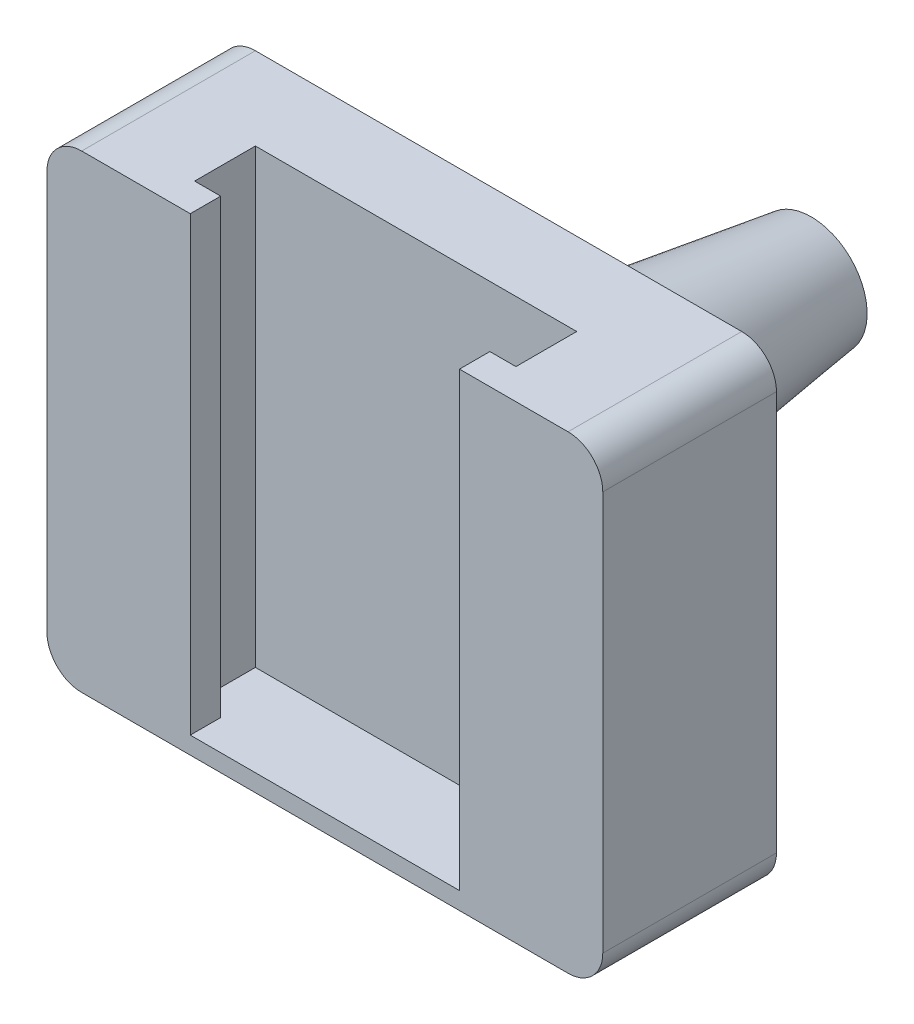
ISO-10303-21;
HEADER;
FILE_DESCRIPTION(('STEP AP214'),'2;1');
FILE_NAME('part.step','',(''),(''),'','','');
FILE_SCHEMA(('AUTOMOTIVE_DESIGN { 1 0 10303 214 1 1 1 1 }'));
ENDSEC;
DATA;
#1=APPLICATION_CONTEXT('core data for automotive mechanical design processes');
#2=APPLICATION_PROTOCOL_DEFINITION('international standard','automotive_design',2000,#1);
#3=PRODUCT_CONTEXT('',#1,'mechanical');
#4=PRODUCT('Part','Part','',(#3));
#5=PRODUCT_RELATED_PRODUCT_CATEGORY('part','',(#4));
#6=PRODUCT_DEFINITION_FORMATION('','',#4);
#7=PRODUCT_DEFINITION_CONTEXT('part definition',#1,'design');
#8=PRODUCT_DEFINITION('design','',#6,#7);
#9=PRODUCT_DEFINITION_SHAPE('','',#8);
#10=(LENGTH_UNIT() NAMED_UNIT(*) SI_UNIT(.MILLI.,.METRE.));
#11=(NAMED_UNIT(*) PLANE_ANGLE_UNIT() SI_UNIT($,.RADIAN.));
#12=(NAMED_UNIT(*) SI_UNIT($,.STERADIAN.) SOLID_ANGLE_UNIT());
#13=UNCERTAINTY_MEASURE_WITH_UNIT(LENGTH_MEASURE(1.E-05),#10,'distance_accuracy_value','');
#14=(GEOMETRIC_REPRESENTATION_CONTEXT(3) GLOBAL_UNCERTAINTY_ASSIGNED_CONTEXT((#13)) GLOBAL_UNIT_ASSIGNED_CONTEXT((#10,
#11,#12)) REPRESENTATION_CONTEXT('',''));
#15=CARTESIAN_POINT('',(0.,0.,0.));
#16=DIRECTION('',(0.,0.,1.));
#17=DIRECTION('',(1.,0.,0.));
#18=AXIS2_PLACEMENT_3D('',#15,#16,#17);
#19=CARTESIAN_POINT('',(0.,0.,10.));
#20=DIRECTION('',(0.,0.,-1.));
#21=DIRECTION('',(-1.,0.,0.));
#22=AXIS2_PLACEMENT_3D('',#19,#20,#21);
#23=PLANE('',#22);
#24=DIRECTION('',(0.,1.,0.));
#25=VECTOR('',#24,1.);
#26=CARTESIAN_POINT('',(7.75,-32.7305096136323,10.));
#27=LINE('',#26,#25);
#28=CARTESIAN_POINT('',(7.75,-12.5000000000001,10.));
#29=VERTEX_POINT('',#28);
#30=CARTESIAN_POINT('',(7.75,13.5,10.));
#31=VERTEX_POINT('',#30);
#32=EDGE_CURVE('E158',#29,#31,#27,.T.);
#33=ORIENTED_EDGE('',*,*,#32,.F.);
#34=DIRECTION('',(-1.,0.,0.));
#35=VECTOR('',#34,1.);
#36=CARTESIAN_POINT('',(-7.75,-12.5000000000001,10.));
#37=LINE('',#36,#35);
#38=CARTESIAN_POINT('',(-7.75,-12.5000000000001,10.));
#39=VERTEX_POINT('',#38);
#40=EDGE_CURVE('E339',#29,#39,#37,.T.);
#41=ORIENTED_EDGE('',*,*,#40,.T.);
#42=DIRECTION('',(0.,1.,0.));
#43=VECTOR('',#42,1.);
#44=CARTESIAN_POINT('',(-7.75,-32.7305096136323,10.));
#45=LINE('',#44,#43);
#46=CARTESIAN_POINT('',(-7.75,13.5,10.));
#47=VERTEX_POINT('',#46);
#48=EDGE_CURVE('E57',#39,#47,#45,.T.);
#49=ORIENTED_EDGE('',*,*,#48,.T.);
#50=DIRECTION('',(1.,0.,0.));
#51=VECTOR('',#50,1.);
#52=CARTESIAN_POINT('',(-15.9999999999999,13.5,10.));
#53=LINE('',#52,#51);
#54=CARTESIAN_POINT('',(-13.9999999999999,13.5,10.));
#55=VERTEX_POINT('',#54);
#56=EDGE_CURVE('E177',#55,#47,#53,.T.);
#57=ORIENTED_EDGE('',*,*,#56,.F.);
#58=CARTESIAN_POINT('',(-13.9999999999999,11.5,10.));
#59=DIRECTION('',(0.,0.,-1.));
#60=DIRECTION('',(-1.,0.,0.));
#61=AXIS2_PLACEMENT_3D('',#58,#59,#60);
#62=CIRCLE('',#61,2.);
#63=CARTESIAN_POINT('',(-15.9999999999999,11.5,10.));
#64=VERTEX_POINT('',#63);
#65=EDGE_CURVE('E225',#55,#64,#62,.F.);
#66=ORIENTED_EDGE('',*,*,#65,.T.);
#67=DIRECTION('',(0.,1.,0.));
#68=VECTOR('',#67,1.);
#69=CARTESIAN_POINT('',(-15.9999999999999,-13.5000000000001,10.));
#70=LINE('',#69,#68);
#71=CARTESIAN_POINT('',(-15.9999999999999,-11.5000000000001,10.));
#72=VERTEX_POINT('',#71);
#73=EDGE_CURVE('E179',#72,#64,#70,.T.);
#74=ORIENTED_EDGE('',*,*,#73,.F.);
#75=CARTESIAN_POINT('',(-13.9999999999999,-11.5000000000001,10.));
#76=DIRECTION('',(0.,0.,-1.));
#77=DIRECTION('',(-1.,0.,0.));
#78=AXIS2_PLACEMENT_3D('',#75,#76,#77);
#79=CIRCLE('',#78,2.);
#80=CARTESIAN_POINT('',(-13.9999999999999,-13.5000000000001,10.));
#81=VERTEX_POINT('',#80);
#82=EDGE_CURVE('E222',#72,#81,#79,.F.);
#83=ORIENTED_EDGE('',*,*,#82,.T.);
#84=DIRECTION('',(1.,0.,0.));
#85=VECTOR('',#84,1.);
#86=CARTESIAN_POINT('',(-15.9999999999999,-13.5000000000001,10.));
#87=LINE('',#86,#85);
#88=CARTESIAN_POINT('',(14.0000000000001,-13.5000000000001,10.));
#89=VERTEX_POINT('',#88);
#90=EDGE_CURVE('E188',#81,#89,#87,.T.);
#91=ORIENTED_EDGE('',*,*,#90,.T.);
#92=CARTESIAN_POINT('',(14.0000000000001,-11.5000000000001,10.));
#93=DIRECTION('',(0.,0.,-1.));
#94=DIRECTION('',(-1.,0.,0.));
#95=AXIS2_PLACEMENT_3D('',#92,#93,#94);
#96=CIRCLE('',#95,2.);
#97=CARTESIAN_POINT('',(16.0000000000001,-11.5000000000001,10.));
#98=VERTEX_POINT('',#97);
#99=EDGE_CURVE('E227',#89,#98,#96,.F.);
#100=ORIENTED_EDGE('',*,*,#99,.T.);
#101=DIRECTION('',(0.,1.,0.));
#102=VECTOR('',#101,1.);
#103=CARTESIAN_POINT('',(16.0000000000001,-13.5000000000001,10.));
#104=LINE('',#103,#102);
#105=CARTESIAN_POINT('',(16.0000000000001,11.5,10.));
#106=VERTEX_POINT('',#105);
#107=EDGE_CURVE('E182',#98,#106,#104,.T.);
#108=ORIENTED_EDGE('',*,*,#107,.T.);
#109=CARTESIAN_POINT('',(14.0000000000001,11.5,10.));
#110=DIRECTION('',(0.,0.,-1.));
#111=DIRECTION('',(-1.,0.,0.));
#112=AXIS2_PLACEMENT_3D('',#109,#110,#111);
#113=CIRCLE('',#112,2.);
#114=CARTESIAN_POINT('',(14.0000000000001,13.5,10.));
#115=VERTEX_POINT('',#114);
#116=EDGE_CURVE('E180',#106,#115,#113,.F.);
#117=ORIENTED_EDGE('',*,*,#116,.T.);
#118=EDGE_CURVE('E61',#31,#115,#53,.T.);
#119=ORIENTED_EDGE('',*,*,#118,.F.);
#120=EDGE_LOOP('',(#33,#41,#49,#57,#66,#74,#83,#91,#100,#108,#117,#119));
#121=FACE_BOUND('',#120,.T.);
#122=ADVANCED_FACE('F41',(#121),#23,.F.);
#123=CARTESIAN_POINT('',(-15.9999999999999,-13.5000000000001,10.));
#124=DIRECTION('',(-1.,0.,0.));
#125=DIRECTION('',(0.,0.,1.));
#126=AXIS2_PLACEMENT_3D('',#123,#124,#125);
#127=PLANE('',#126);
#128=DIRECTION('',(0.,1.,0.));
#129=VECTOR('',#128,1.);
#130=CARTESIAN_POINT('',(-15.9999999999999,-13.5000000000001,0.));
#131=LINE('',#130,#129);
#132=CARTESIAN_POINT('',(-15.9999999999999,-11.5000000000001,0.));
#133=VERTEX_POINT('',#132);
#134=CARTESIAN_POINT('',(-15.9999999999999,11.5,0.));
#135=VERTEX_POINT('',#134);
#136=EDGE_CURVE('E191',#133,#135,#131,.T.);
#137=ORIENTED_EDGE('',*,*,#136,.F.);
#138=DIRECTION('',(0.,0.,-1.));
#139=VECTOR('',#138,1.);
#140=CARTESIAN_POINT('',(-15.9999999999999,-11.5000000000001,10.));
#141=LINE('',#140,#139);
#142=EDGE_CURVE('E235',#133,#72,#141,.F.);
#143=ORIENTED_EDGE('',*,*,#142,.T.);
#144=ORIENTED_EDGE('',*,*,#73,.T.);
#145=DIRECTION('',(0.,0.,-1.));
#146=VECTOR('',#145,1.);
#147=CARTESIAN_POINT('',(-15.9999999999999,11.5,10.));
#148=LINE('',#147,#146);
#149=EDGE_CURVE('E230',#64,#135,#148,.T.);
#150=ORIENTED_EDGE('',*,*,#149,.T.);
#151=EDGE_LOOP('',(#137,#143,#144,#150));
#152=FACE_BOUND('',#151,.T.);
#153=ADVANCED_FACE('F251',(#152),#127,.T.);
#154=CARTESIAN_POINT('',(-15.9999999999999,-13.5000000000001,10.));
#155=DIRECTION('',(0.,1.,0.));
#156=DIRECTION('',(0.,0.,1.));
#157=AXIS2_PLACEMENT_3D('',#154,#155,#156);
#158=PLANE('',#157);
#159=DIRECTION('',(1.,0.,0.));
#160=VECTOR('',#159,1.);
#161=CARTESIAN_POINT('',(-15.9999999999999,-13.5000000000001,0.));
#162=LINE('',#161,#160);
#163=CARTESIAN_POINT('',(-13.9999999999999,-13.5000000000001,0.));
#164=VERTEX_POINT('',#163);
#165=CARTESIAN_POINT('',(14.0000000000001,-13.5000000000001,0.));
#166=VERTEX_POINT('',#165);
#167=EDGE_CURVE('E184',#164,#166,#162,.T.);
#168=ORIENTED_EDGE('',*,*,#167,.T.);
#169=DIRECTION('',(0.,0.,-1.));
#170=VECTOR('',#169,1.);
#171=CARTESIAN_POINT('',(14.0000000000001,-13.5000000000001,10.));
#172=LINE('',#171,#170);
#173=EDGE_CURVE('E216',#166,#89,#172,.F.);
#174=ORIENTED_EDGE('',*,*,#173,.T.);
#175=ORIENTED_EDGE('',*,*,#90,.F.);
#176=DIRECTION('',(0.,0.,-1.));
#177=VECTOR('',#176,1.);
#178=CARTESIAN_POINT('',(-13.9999999999999,-13.5000000000001,0.));
#179=LINE('',#178,#177);
#180=EDGE_CURVE('E219',#81,#164,#179,.T.);
#181=ORIENTED_EDGE('',*,*,#180,.T.);
#182=EDGE_LOOP('',(#168,#174,#175,#181));
#183=FACE_BOUND('',#182,.T.);
#184=ADVANCED_FACE('F263',(#183),#158,.F.);
#185=CARTESIAN_POINT('',(16.0000000000001,-13.5000000000001,10.));
#186=DIRECTION('',(-1.,0.,0.));
#187=DIRECTION('',(0.,0.,1.));
#188=AXIS2_PLACEMENT_3D('',#185,#186,#187);
#189=PLANE('',#188);
#190=ORIENTED_EDGE('',*,*,#107,.F.);
#191=DIRECTION('',(0.,0.,-1.));
#192=VECTOR('',#191,1.);
#193=CARTESIAN_POINT('',(16.0000000000001,-11.5000000000001,10.));
#194=LINE('',#193,#192);
#195=CARTESIAN_POINT('',(16.0000000000001,-11.5000000000001,0.));
#196=VERTEX_POINT('',#195);
#197=EDGE_CURVE('E207',#98,#196,#194,.T.);
#198=ORIENTED_EDGE('',*,*,#197,.T.);
#199=DIRECTION('',(0.,1.,0.));
#200=VECTOR('',#199,1.);
#201=CARTESIAN_POINT('',(16.0000000000001,-13.5000000000001,0.));
#202=LINE('',#201,#200);
#203=CARTESIAN_POINT('',(16.0000000000001,11.5,0.));
#204=VERTEX_POINT('',#203);
#205=EDGE_CURVE('E196',#196,#204,#202,.T.);
#206=ORIENTED_EDGE('',*,*,#205,.T.);
#207=DIRECTION('',(0.,0.,-1.));
#208=VECTOR('',#207,1.);
#209=CARTESIAN_POINT('',(16.0000000000001,11.5,10.));
#210=LINE('',#209,#208);
#211=EDGE_CURVE('E194',#204,#106,#210,.F.);
#212=ORIENTED_EDGE('',*,*,#211,.T.);
#213=EDGE_LOOP('',(#190,#198,#206,#212));
#214=FACE_BOUND('',#213,.T.);
#215=ADVANCED_FACE('F274',(#214),#189,.F.);
#216=CARTESIAN_POINT('',(-15.9999999999999,13.5,10.));
#217=DIRECTION('',(0.,1.,0.));
#218=DIRECTION('',(0.,0.,1.));
#219=AXIS2_PLACEMENT_3D('',#216,#217,#218);
#220=PLANE('',#219);
#221=DIRECTION('',(0.,0.,-1.));
#222=VECTOR('',#221,1.);
#223=CARTESIAN_POINT('',(7.75,13.5,8.25));
#224=LINE('',#223,#222);
#225=CARTESIAN_POINT('',(7.75,13.5,8.25));
#226=VERTEX_POINT('',#225);
#227=EDGE_CURVE('E159',#31,#226,#224,.T.);
#228=ORIENTED_EDGE('',*,*,#227,.F.);
#229=ORIENTED_EDGE('',*,*,#118,.T.);
#230=DIRECTION('',(0.,0.,-1.));
#231=VECTOR('',#230,1.);
#232=CARTESIAN_POINT('',(14.0000000000001,13.5,0.));
#233=LINE('',#232,#231);
#234=CARTESIAN_POINT('',(14.0000000000001,13.5,0.));
#235=VERTEX_POINT('',#234);
#236=EDGE_CURVE('E236',#115,#235,#233,.T.);
#237=ORIENTED_EDGE('',*,*,#236,.T.);
#238=DIRECTION('',(1.,0.,0.));
#239=VECTOR('',#238,1.);
#240=CARTESIAN_POINT('',(-15.9999999999999,13.5,0.));
#241=LINE('',#240,#239);
#242=CARTESIAN_POINT('',(-13.9999999999999,13.5,0.));
#243=VERTEX_POINT('',#242);
#244=EDGE_CURVE('E199',#243,#235,#241,.T.);
#245=ORIENTED_EDGE('',*,*,#244,.F.);
#246=DIRECTION('',(0.,0.,-1.));
#247=VECTOR('',#246,1.);
#248=CARTESIAN_POINT('',(-13.9999999999999,13.5,10.));
#249=LINE('',#248,#247);
#250=EDGE_CURVE('E234',#243,#55,#249,.F.);
#251=ORIENTED_EDGE('',*,*,#250,.T.);
#252=ORIENTED_EDGE('',*,*,#56,.T.);
#253=DIRECTION('',(0.,0.,1.));
#254=VECTOR('',#253,1.);
#255=CARTESIAN_POINT('',(-7.75,13.5,10.));
#256=LINE('',#255,#254);
#257=CARTESIAN_POINT('',(-7.75,13.5,8.25));
#258=VERTEX_POINT('',#257);
#259=EDGE_CURVE('E170',#258,#47,#256,.T.);
#260=ORIENTED_EDGE('',*,*,#259,.F.);
#261=DIRECTION('',(1.,0.,0.));
#262=VECTOR('',#261,1.);
#263=CARTESIAN_POINT('',(-7.75,13.5,8.25));
#264=LINE('',#263,#262);
#265=CARTESIAN_POINT('',(-9.24999999999993,13.5,8.25));
#266=VERTEX_POINT('',#265);
#267=EDGE_CURVE('E322',#266,#258,#264,.T.);
#268=ORIENTED_EDGE('',*,*,#267,.F.);
#269=DIRECTION('',(0.,0.,1.));
#270=VECTOR('',#269,1.);
#271=CARTESIAN_POINT('',(-9.24999999999993,13.5,8.25));
#272=LINE('',#271,#270);
#273=CARTESIAN_POINT('',(-9.25,13.5,4.75));
#274=VERTEX_POINT('',#273);
#275=EDGE_CURVE('E324',#274,#266,#272,.T.);
#276=ORIENTED_EDGE('',*,*,#275,.F.);
#277=DIRECTION('',(-1.,0.,0.));
#278=VECTOR('',#277,1.);
#279=CARTESIAN_POINT('',(-9.25,13.5,4.75));
#280=LINE('',#279,#278);
#281=CARTESIAN_POINT('',(9.25,13.5,4.75));
#282=VERTEX_POINT('',#281);
#283=EDGE_CURVE('E346',#282,#274,#280,.T.);
#284=ORIENTED_EDGE('',*,*,#283,.F.);
#285=DIRECTION('',(0.,0.,-1.));
#286=VECTOR('',#285,1.);
#287=CARTESIAN_POINT('',(9.25,13.5,4.75));
#288=LINE('',#287,#286);
#289=CARTESIAN_POINT('',(9.24999999999993,13.5,8.25));
#290=VERTEX_POINT('',#289);
#291=EDGE_CURVE('E349',#290,#282,#288,.T.);
#292=ORIENTED_EDGE('',*,*,#291,.F.);
#293=DIRECTION('',(1.,0.,0.));
#294=VECTOR('',#293,1.);
#295=CARTESIAN_POINT('',(9.24999999999993,13.5,8.25));
#296=LINE('',#295,#294);
#297=EDGE_CURVE('E175',#226,#290,#296,.T.);
#298=ORIENTED_EDGE('',*,*,#297,.F.);
#299=EDGE_LOOP('',(#228,#229,#237,#245,#251,#252,#260,#268,#276,#284,#292,#298));
#300=FACE_BOUND('',#299,.T.);
#301=ADVANCED_FACE('F169',(#300),#220,.T.);
#302=CARTESIAN_POINT('',(0.,0.,0.));
#303=DIRECTION('',(0.,0.,-1.));
#304=DIRECTION('',(-1.,0.,0.));
#305=AXIS2_PLACEMENT_3D('',#302,#303,#304);
#306=PLANE('',#305);
#307=CARTESIAN_POINT('',(0.,0.,0.));
#308=DIRECTION('',(0.,0.,-1.));
#309=DIRECTION('',(-1.,0.,0.));
#310=AXIS2_PLACEMENT_3D('',#307,#308,#309);
#311=CIRCLE('',#310,7.48857347563245);
#312=CARTESIAN_POINT('',(-7.48857347563245,0.,0.));
#313=VERTEX_POINT('',#312);
#314=EDGE_CURVE('E12',#313,#313,#311,.F.);
#315=ORIENTED_EDGE('',*,*,#314,.T.);
#316=EDGE_LOOP('',(#315));
#317=FACE_BOUND('',#316,.T.);
#318=ORIENTED_EDGE('',*,*,#205,.F.);
#319=CARTESIAN_POINT('',(14.0000000000001,-11.5000000000001,0.));
#320=DIRECTION('',(0.,0.,-1.));
#321=DIRECTION('',(-1.,0.,0.));
#322=AXIS2_PLACEMENT_3D('',#319,#320,#321);
#323=CIRCLE('',#322,2.);
#324=EDGE_CURVE('E213',#196,#166,#323,.T.);
#325=ORIENTED_EDGE('',*,*,#324,.T.);
#326=ORIENTED_EDGE('',*,*,#167,.F.);
#327=CARTESIAN_POINT('',(-13.9999999999999,-11.5000000000001,0.));
#328=DIRECTION('',(0.,0.,-1.));
#329=DIRECTION('',(-1.,0.,0.));
#330=AXIS2_PLACEMENT_3D('',#327,#328,#329);
#331=CIRCLE('',#330,2.);
#332=EDGE_CURVE('E214',#164,#133,#331,.T.);
#333=ORIENTED_EDGE('',*,*,#332,.T.);
#334=ORIENTED_EDGE('',*,*,#136,.T.);
#335=CARTESIAN_POINT('',(-13.9999999999999,11.5,0.));
#336=DIRECTION('',(0.,0.,-1.));
#337=DIRECTION('',(-1.,0.,0.));
#338=AXIS2_PLACEMENT_3D('',#335,#336,#337);
#339=CIRCLE('',#338,2.);
#340=EDGE_CURVE('E209',#135,#243,#339,.T.);
#341=ORIENTED_EDGE('',*,*,#340,.T.);
#342=ORIENTED_EDGE('',*,*,#244,.T.);
#343=CARTESIAN_POINT('',(14.0000000000001,11.5,0.));
#344=DIRECTION('',(0.,0.,-1.));
#345=DIRECTION('',(-1.,0.,0.));
#346=AXIS2_PLACEMENT_3D('',#343,#344,#345);
#347=CIRCLE('',#346,2.);
#348=EDGE_CURVE('E212',#235,#204,#347,.T.);
#349=ORIENTED_EDGE('',*,*,#348,.T.);
#350=EDGE_LOOP('',(#318,#325,#326,#333,#334,#341,#342,#349));
#351=FACE_BOUND('',#350,.T.);
#352=ADVANCED_FACE('F270',(#317,#351),#306,.T.);
#353=CARTESIAN_POINT('',(14.0000000000001,-11.5000000000001,10.));
#354=DIRECTION('',(0.,0.,-1.));
#355=DIRECTION('',(-1.,0.,0.));
#356=AXIS2_PLACEMENT_3D('',#353,#354,#355);
#357=CYLINDRICAL_SURFACE('',#356,2.);
#358=ORIENTED_EDGE('',*,*,#99,.F.);
#359=ORIENTED_EDGE('',*,*,#173,.F.);
#360=ORIENTED_EDGE('',*,*,#324,.F.);
#361=ORIENTED_EDGE('',*,*,#197,.F.);
#362=EDGE_LOOP('',(#358,#359,#360,#361));
#363=FACE_BOUND('',#362,.T.);
#364=ADVANCED_FACE('F267',(#363),#357,.T.);
#365=CARTESIAN_POINT('',(-13.9999999999999,-11.5000000000001,10.));
#366=DIRECTION('',(0.,0.,1.));
#367=DIRECTION('',(1.,0.,0.));
#368=AXIS2_PLACEMENT_3D('',#365,#366,#367);
#369=CYLINDRICAL_SURFACE('',#368,2.);
#370=ORIENTED_EDGE('',*,*,#82,.F.);
#371=ORIENTED_EDGE('',*,*,#142,.F.);
#372=ORIENTED_EDGE('',*,*,#332,.F.);
#373=ORIENTED_EDGE('',*,*,#180,.F.);
#374=EDGE_LOOP('',(#370,#371,#372,#373));
#375=FACE_BOUND('',#374,.T.);
#376=ADVANCED_FACE('F284',(#375),#369,.T.);
#377=CARTESIAN_POINT('',(14.0000000000001,11.5,10.));
#378=DIRECTION('',(0.,0.,1.));
#379=DIRECTION('',(1.,0.,0.));
#380=AXIS2_PLACEMENT_3D('',#377,#378,#379);
#381=CYLINDRICAL_SURFACE('',#380,2.);
#382=ORIENTED_EDGE('',*,*,#116,.F.);
#383=ORIENTED_EDGE('',*,*,#211,.F.);
#384=ORIENTED_EDGE('',*,*,#348,.F.);
#385=ORIENTED_EDGE('',*,*,#236,.F.);
#386=EDGE_LOOP('',(#382,#383,#384,#385));
#387=FACE_BOUND('',#386,.T.);
#388=ADVANCED_FACE('F288',(#387),#381,.T.);
#389=CARTESIAN_POINT('',(-13.9999999999999,11.5,10.));
#390=DIRECTION('',(0.,0.,-1.));
#391=DIRECTION('',(-1.,0.,0.));
#392=AXIS2_PLACEMENT_3D('',#389,#390,#391);
#393=CYLINDRICAL_SURFACE('',#392,2.);
#394=ORIENTED_EDGE('',*,*,#65,.F.);
#395=ORIENTED_EDGE('',*,*,#250,.F.);
#396=ORIENTED_EDGE('',*,*,#340,.F.);
#397=ORIENTED_EDGE('',*,*,#149,.F.);
#398=EDGE_LOOP('',(#394,#395,#396,#397));
#399=FACE_BOUND('',#398,.T.);
#400=ADVANCED_FACE('F289',(#399),#393,.T.);
#401=CARTESIAN_POINT('',(-7.75,-32.7305096136323,10.));
#402=DIRECTION('',(-1.,0.,0.));
#403=DIRECTION('',(0.,0.,1.));
#404=AXIS2_PLACEMENT_3D('',#401,#402,#403);
#405=PLANE('',#404);
#406=DIRECTION('',(0.,0.,-1.));
#407=VECTOR('',#406,1.);
#408=CARTESIAN_POINT('',(-7.75,-12.5000000000001,10.));
#409=LINE('',#408,#407);
#410=CARTESIAN_POINT('',(-7.75,-12.5000000000001,8.25));
#411=VERTEX_POINT('',#410);
#412=EDGE_CURVE('E338',#39,#411,#409,.T.);
#413=ORIENTED_EDGE('',*,*,#412,.T.);
#414=DIRECTION('',(0.,1.,0.));
#415=VECTOR('',#414,1.);
#416=CARTESIAN_POINT('',(-7.75,-32.7305096136323,8.25));
#417=LINE('',#416,#415);
#418=EDGE_CURVE('E330',#411,#258,#417,.T.);
#419=ORIENTED_EDGE('',*,*,#418,.T.);
#420=ORIENTED_EDGE('',*,*,#259,.T.);
#421=ORIENTED_EDGE('',*,*,#48,.F.);
#422=EDGE_LOOP('',(#413,#419,#420,#421));
#423=FACE_BOUND('',#422,.T.);
#424=ADVANCED_FACE('F293',(#423),#405,.F.);
#425=CARTESIAN_POINT('',(-7.75,-32.7305096136323,8.25));
#426=DIRECTION('',(0.,0.,1.));
#427=DIRECTION('',(1.,0.,0.));
#428=AXIS2_PLACEMENT_3D('',#425,#426,#427);
#429=PLANE('',#428);
#430=DIRECTION('',(-1.,0.,0.));
#431=VECTOR('',#430,1.);
#432=CARTESIAN_POINT('',(-7.75,-12.5000000000001,8.25));
#433=LINE('',#432,#431);
#434=CARTESIAN_POINT('',(-9.24999999999993,-12.5000000000001,8.25));
#435=VERTEX_POINT('',#434);
#436=EDGE_CURVE('E345',#411,#435,#433,.T.);
#437=ORIENTED_EDGE('',*,*,#436,.T.);
#438=DIRECTION('',(0.,1.,0.));
#439=VECTOR('',#438,1.);
#440=CARTESIAN_POINT('',(-9.24999999999993,-32.7305096136323,8.25));
#441=LINE('',#440,#439);
#442=EDGE_CURVE('E333',#435,#266,#441,.T.);
#443=ORIENTED_EDGE('',*,*,#442,.T.);
#444=ORIENTED_EDGE('',*,*,#267,.T.);
#445=ORIENTED_EDGE('',*,*,#418,.F.);
#446=EDGE_LOOP('',(#437,#443,#444,#445));
#447=FACE_BOUND('',#446,.T.);
#448=ADVANCED_FACE('F298',(#447),#429,.F.);
#449=CARTESIAN_POINT('',(-9.24999999999993,-32.7305096136323,8.25));
#450=DIRECTION('',(-1.,0.,0.));
#451=DIRECTION('',(0.,0.,1.));
#452=AXIS2_PLACEMENT_3D('',#449,#450,#451);
#453=PLANE('',#452);
#454=DIRECTION('',(0.,0.,-1.));
#455=VECTOR('',#454,1.);
#456=CARTESIAN_POINT('',(-9.24999999999993,-12.5000000000001,8.25));
#457=LINE('',#456,#455);
#458=CARTESIAN_POINT('',(-9.25,-12.5000000000001,4.75));
#459=VERTEX_POINT('',#458);
#460=EDGE_CURVE('E380',#435,#459,#457,.T.);
#461=ORIENTED_EDGE('',*,*,#460,.T.);
#462=DIRECTION('',(0.,1.,0.));
#463=VECTOR('',#462,1.);
#464=CARTESIAN_POINT('',(-9.25,-32.7305096136323,4.75));
#465=LINE('',#464,#463);
#466=EDGE_CURVE('E331',#459,#274,#465,.T.);
#467=ORIENTED_EDGE('',*,*,#466,.T.);
#468=ORIENTED_EDGE('',*,*,#275,.T.);
#469=ORIENTED_EDGE('',*,*,#442,.F.);
#470=EDGE_LOOP('',(#461,#467,#468,#469));
#471=FACE_BOUND('',#470,.T.);
#472=ADVANCED_FACE('F352',(#471),#453,.F.);
#473=CARTESIAN_POINT('',(-9.25,-32.7305096136323,4.75));
#474=DIRECTION('',(0.,0.,-1.));
#475=DIRECTION('',(-1.,0.,0.));
#476=AXIS2_PLACEMENT_3D('',#473,#474,#475);
#477=PLANE('',#476);
#478=DIRECTION('',(1.,0.,0.));
#479=VECTOR('',#478,1.);
#480=CARTESIAN_POINT('',(-9.25,-12.5000000000001,4.75));
#481=LINE('',#480,#479);
#482=CARTESIAN_POINT('',(9.25,-12.5000000000001,4.75));
#483=VERTEX_POINT('',#482);
#484=EDGE_CURVE('E365',#459,#483,#481,.T.);
#485=ORIENTED_EDGE('',*,*,#484,.T.);
#486=DIRECTION('',(0.,1.,0.));
#487=VECTOR('',#486,1.);
#488=CARTESIAN_POINT('',(9.25,-32.7305096136323,4.75));
#489=LINE('',#488,#487);
#490=EDGE_CURVE('E332',#483,#282,#489,.T.);
#491=ORIENTED_EDGE('',*,*,#490,.T.);
#492=ORIENTED_EDGE('',*,*,#283,.T.);
#493=ORIENTED_EDGE('',*,*,#466,.F.);
#494=EDGE_LOOP('',(#485,#491,#492,#493));
#495=FACE_BOUND('',#494,.T.);
#496=ADVANCED_FACE('F360',(#495),#477,.F.);
#497=CARTESIAN_POINT('',(9.25,-32.7305096136323,4.75));
#498=DIRECTION('',(1.,0.,0.));
#499=DIRECTION('',(0.,0.,-1.));
#500=AXIS2_PLACEMENT_3D('',#497,#498,#499);
#501=PLANE('',#500);
#502=DIRECTION('',(0.,0.,1.));
#503=VECTOR('',#502,1.);
#504=CARTESIAN_POINT('',(9.25,-12.5000000000001,4.75));
#505=LINE('',#504,#503);
#506=CARTESIAN_POINT('',(9.24999999999993,-12.5000000000001,8.25));
#507=VERTEX_POINT('',#506);
#508=EDGE_CURVE('E370',#483,#507,#505,.T.);
#509=ORIENTED_EDGE('',*,*,#508,.T.);
#510=DIRECTION('',(0.,1.,0.));
#511=VECTOR('',#510,1.);
#512=CARTESIAN_POINT('',(9.24999999999993,-32.7305096136323,8.25));
#513=LINE('',#512,#511);
#514=EDGE_CURVE('E340',#507,#290,#513,.T.);
#515=ORIENTED_EDGE('',*,*,#514,.T.);
#516=ORIENTED_EDGE('',*,*,#291,.T.);
#517=ORIENTED_EDGE('',*,*,#490,.F.);
#518=EDGE_LOOP('',(#509,#515,#516,#517));
#519=FACE_BOUND('',#518,.T.);
#520=ADVANCED_FACE('F362',(#519),#501,.F.);
#521=CARTESIAN_POINT('',(9.24999999999993,-32.7305096136323,8.25));
#522=DIRECTION('',(0.,0.,1.));
#523=DIRECTION('',(1.,0.,0.));
#524=AXIS2_PLACEMENT_3D('',#521,#522,#523);
#525=PLANE('',#524);
#526=DIRECTION('',(-1.,0.,0.));
#527=VECTOR('',#526,1.);
#528=CARTESIAN_POINT('',(9.24999999999993,-12.5000000000001,8.25));
#529=LINE('',#528,#527);
#530=CARTESIAN_POINT('',(7.75,-12.5000000000001,8.25));
#531=VERTEX_POINT('',#530);
#532=EDGE_CURVE('E327',#507,#531,#529,.T.);
#533=ORIENTED_EDGE('',*,*,#532,.T.);
#534=DIRECTION('',(0.,1.,0.));
#535=VECTOR('',#534,1.);
#536=CARTESIAN_POINT('',(7.75,-32.7305096136323,8.25));
#537=LINE('',#536,#535);
#538=EDGE_CURVE('E168',#531,#226,#537,.T.);
#539=ORIENTED_EDGE('',*,*,#538,.T.);
#540=ORIENTED_EDGE('',*,*,#297,.T.);
#541=ORIENTED_EDGE('',*,*,#514,.F.);
#542=EDGE_LOOP('',(#533,#539,#540,#541));
#543=FACE_BOUND('',#542,.T.);
#544=ADVANCED_FACE('F369',(#543),#525,.F.);
#545=CARTESIAN_POINT('',(7.75,-32.7305096136323,8.25));
#546=DIRECTION('',(1.,0.,0.));
#547=DIRECTION('',(0.,0.,-1.));
#548=AXIS2_PLACEMENT_3D('',#545,#546,#547);
#549=PLANE('',#548);
#550=DIRECTION('',(0.,0.,1.));
#551=VECTOR('',#550,1.);
#552=CARTESIAN_POINT('',(7.75,-12.5000000000001,8.25));
#553=LINE('',#552,#551);
#554=EDGE_CURVE('E162',#531,#29,#553,.T.);
#555=ORIENTED_EDGE('',*,*,#554,.T.);
#556=ORIENTED_EDGE('',*,*,#32,.T.);
#557=ORIENTED_EDGE('',*,*,#227,.T.);
#558=ORIENTED_EDGE('',*,*,#538,.F.);
#559=EDGE_LOOP('',(#555,#556,#557,#558));
#560=FACE_BOUND('',#559,.T.);
#561=ADVANCED_FACE('F160',(#560),#549,.F.);
#562=CARTESIAN_POINT('',(-15.9999999999999,-12.5000000000001,10.));
#563=DIRECTION('',(0.,1.,0.));
#564=DIRECTION('',(0.,0.,1.));
#565=AXIS2_PLACEMENT_3D('',#562,#563,#564);
#566=PLANE('',#565);
#567=ORIENTED_EDGE('',*,*,#40,.F.);
#568=ORIENTED_EDGE('',*,*,#554,.F.);
#569=ORIENTED_EDGE('',*,*,#532,.F.);
#570=ORIENTED_EDGE('',*,*,#508,.F.);
#571=ORIENTED_EDGE('',*,*,#484,.F.);
#572=ORIENTED_EDGE('',*,*,#460,.F.);
#573=ORIENTED_EDGE('',*,*,#436,.F.);
#574=ORIENTED_EDGE('',*,*,#412,.F.);
#575=EDGE_LOOP('',(#567,#568,#569,#570,#571,#572,#573,#574));
#576=FACE_BOUND('',#575,.T.);
#577=ADVANCED_FACE('F375',(#576),#566,.T.);
#578=CARTESIAN_POINT('',(0.,0.,0.));
#579=DIRECTION('',(0.,0.,1.));
#580=DIRECTION('',(-1.,0.,0.));
#581=AXIS2_PLACEMENT_3D('',#578,#579,#580);
#582=CONICAL_SURFACE('',#581,5.75,0.139626340159547);
#583=CARTESIAN_POINT('',(0.,0.,-1.72165379807988));
#584=DIRECTION('',(0.,0.,-1.));
#585=DIRECTION('',(-1.,0.,0.));
#586=AXIS2_PLACEMENT_3D('',#583,#584,#585);
#587=CIRCLE('',#586,5.50803733814931);
#588=CARTESIAN_POINT('',(-5.50803733814931,0.,-1.72165379807988));
#589=VERTEX_POINT('',#588);
#590=EDGE_CURVE('E47',#589,#589,#587,.T.);
#591=ORIENTED_EDGE('',*,*,#590,.T.);
#592=EDGE_LOOP('',(#591));
#593=FACE_BOUND('',#592,.T.);
#594=CARTESIAN_POINT('',(0.,0.,-18.));
#595=DIRECTION('',(0.,0.,-1.));
#596=DIRECTION('',(-1.,0.,0.));
#597=AXIS2_PLACEMENT_3D('',#594,#595,#596);
#598=CIRCLE('',#597,3.22026497535695);
#599=CARTESIAN_POINT('',(-3.22026497535695,0.,-18.));
#600=VERTEX_POINT('',#599);
#601=EDGE_CURVE('E173',#600,#600,#598,.T.);
#602=ORIENTED_EDGE('',*,*,#601,.F.);
#603=EDGE_LOOP('',(#602));
#604=FACE_BOUND('',#603,.T.);
#605=ADVANCED_FACE('F239',(#593,#604),#582,.T.);
#606=CARTESIAN_POINT('',(0.,0.,-18.));
#607=DIRECTION('',(0.,0.,-1.));
#608=DIRECTION('',(-1.,0.,0.));
#609=AXIS2_PLACEMENT_3D('',#606,#607,#608);
#610=PLANE('',#609);
#611=ORIENTED_EDGE('',*,*,#601,.T.);
#612=EDGE_LOOP('',(#611));
#613=FACE_BOUND('',#612,.T.);
#614=ADVANCED_FACE('F242',(#613),#610,.T.);
#615=CARTESIAN_POINT('',(0.,0.,-2.));
#616=DIRECTION('',(0.,0.,-1.));
#617=DIRECTION('',(-1.,0.,0.));
#618=AXIS2_PLACEMENT_3D('',#615,#616,#617);
#619=TOROIDAL_SURFACE('',#618,7.48857347563245,2.);
#620=ORIENTED_EDGE('',*,*,#314,.F.);
#621=EDGE_LOOP('',(#620));
#622=FACE_BOUND('',#621,.T.);
#623=ORIENTED_EDGE('',*,*,#590,.F.);
#624=EDGE_LOOP('',(#623));
#625=FACE_BOUND('',#624,.T.);
#626=ADVANCED_FACE('F43',(#622,#625),#619,.F.);
#627=CLOSED_SHELL('',(#122,#153,#184,#215,#301,#352,#364,#376,#388,#400,#424,#448,#472,#496,
#520,#544,#561,#577,#605,#614,#626));
#628=MANIFOLD_SOLID_BREP('B2',#627);
#629=ADVANCED_BREP_SHAPE_REPRESENTATION('',(#18,#628),#14);
#630=SHAPE_DEFINITION_REPRESENTATION(#9,#629);
ENDSEC;
END-ISO-10303-21;
